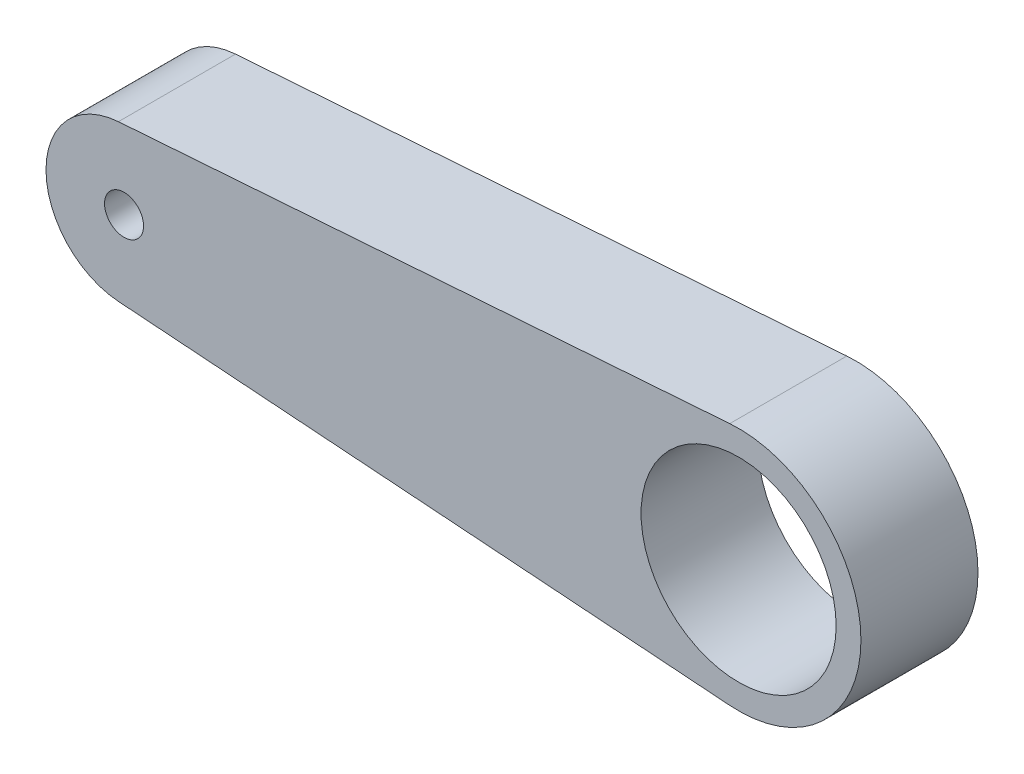
ISO-10303-21;
HEADER;
FILE_DESCRIPTION(('STEP AP214'),'2;1');
FILE_NAME('part.step','',(''),(''),'','','');
FILE_SCHEMA(('AUTOMOTIVE_DESIGN { 1 0 10303 214 1 1 1 1 }'));
ENDSEC;
DATA;
#1=APPLICATION_CONTEXT('core data for automotive mechanical design processes');
#2=APPLICATION_PROTOCOL_DEFINITION('international standard','automotive_design',2000,#1);
#3=PRODUCT_CONTEXT('',#1,'mechanical');
#4=PRODUCT('Part','Part','',(#3));
#5=PRODUCT_RELATED_PRODUCT_CATEGORY('part','',(#4));
#6=PRODUCT_DEFINITION_FORMATION('','',#4);
#7=PRODUCT_DEFINITION_CONTEXT('part definition',#1,'design');
#8=PRODUCT_DEFINITION('design','',#6,#7);
#9=PRODUCT_DEFINITION_SHAPE('','',#8);
#10=(LENGTH_UNIT() NAMED_UNIT(*) SI_UNIT(.MILLI.,.METRE.));
#11=(NAMED_UNIT(*) PLANE_ANGLE_UNIT() SI_UNIT($,.RADIAN.));
#12=(NAMED_UNIT(*) SI_UNIT($,.STERADIAN.) SOLID_ANGLE_UNIT());
#13=UNCERTAINTY_MEASURE_WITH_UNIT(LENGTH_MEASURE(1.E-05),#10,'distance_accuracy_value','');
#14=(GEOMETRIC_REPRESENTATION_CONTEXT(3) GLOBAL_UNCERTAINTY_ASSIGNED_CONTEXT((#13)) GLOBAL_UNIT_ASSIGNED_CONTEXT((#10,
#11,#12)) REPRESENTATION_CONTEXT('',''));
#15=CARTESIAN_POINT('',(0.,0.,0.));
#16=DIRECTION('',(0.,0.,1.));
#17=DIRECTION('',(1.,0.,0.));
#18=AXIS2_PLACEMENT_3D('',#15,#16,#17);
#19=CARTESIAN_POINT('',(0.,0.,1.5));
#20=DIRECTION('',(0.,0.,1.));
#21=DIRECTION('',(1.,0.,0.));
#22=AXIS2_PLACEMENT_3D('',#19,#20,#21);
#23=PLANE('',#22);
#24=CARTESIAN_POINT('',(0.,0.,1.5));
#25=DIRECTION('',(0.,0.,1.));
#26=DIRECTION('',(1.,0.,0.));
#27=AXIS2_PLACEMENT_3D('',#24,#25,#26);
#28=CIRCLE('',#27,0.5);
#29=CARTESIAN_POINT('',(0.5,0.,1.5));
#30=VERTEX_POINT('',#29);
#31=EDGE_CURVE('E113',#30,#30,#28,.T.);
#32=ORIENTED_EDGE('',*,*,#31,.F.);
#33=EDGE_LOOP('',(#32));
#34=FACE_BOUND('',#33,.T.);
#35=DIRECTION('',(0.99739743106567,-0.0720996844903074,0.));
#36=VECTOR('',#35,1.);
#37=CARTESIAN_POINT('',(-0.144199368980615,-1.99479486213134,1.5));
#38=LINE('',#37,#36);
#39=CARTESIAN_POINT('',(-0.144199368980615,-1.99479486213134,1.5));
#40=VERTEX_POINT('',#39);
#41=CARTESIAN_POINT('',(15.5239263900877,-3.12740949356897,1.5));
#42=VERTEX_POINT('',#41);
#43=EDGE_CURVE('E102',#40,#42,#38,.T.);
#44=ORIENTED_EDGE('',*,*,#43,.T.);
#45=CARTESIAN_POINT('',(15.75,0.,1.5));
#46=DIRECTION('',(0.,0.,1.));
#47=DIRECTION('',(1.,0.,0.));
#48=AXIS2_PLACEMENT_3D('',#45,#46,#47);
#49=CIRCLE('',#48,3.13557003072234);
#50=CARTESIAN_POINT('',(15.5239263900877,3.12740949356897,1.5));
#51=VERTEX_POINT('',#50);
#52=EDGE_CURVE('E97',#42,#51,#49,.T.);
#53=ORIENTED_EDGE('',*,*,#52,.T.);
#54=DIRECTION('',(0.99739743106567,0.0720996844903075,0.));
#55=VECTOR('',#54,1.);
#56=CARTESIAN_POINT('',(-0.144199368980615,1.99479486213134,1.5));
#57=LINE('',#56,#55);
#58=CARTESIAN_POINT('',(-0.144199368980615,1.99479486213134,1.5));
#59=VERTEX_POINT('',#58);
#60=EDGE_CURVE('E100',#59,#51,#57,.T.);
#61=ORIENTED_EDGE('',*,*,#60,.F.);
#62=CARTESIAN_POINT('',(0.,0.,1.5));
#63=DIRECTION('',(0.,0.,1.));
#64=DIRECTION('',(1.,0.,0.));
#65=AXIS2_PLACEMENT_3D('',#62,#63,#64);
#66=CIRCLE('',#65,2.);
#67=EDGE_CURVE('E71',#59,#40,#66,.T.);
#68=ORIENTED_EDGE('',*,*,#67,.T.);
#69=EDGE_LOOP('',(#44,#53,#61,#68));
#70=FACE_BOUND('',#69,.T.);
#71=CARTESIAN_POINT('',(15.75,0.,1.5));
#72=DIRECTION('',(0.,0.,1.));
#73=DIRECTION('',(1.,0.,0.));
#74=AXIS2_PLACEMENT_3D('',#71,#72,#73);
#75=CIRCLE('',#74,2.5);
#76=CARTESIAN_POINT('',(18.25,0.,1.5));
#77=VERTEX_POINT('',#76);
#78=EDGE_CURVE('E123',#77,#77,#75,.T.);
#79=ORIENTED_EDGE('',*,*,#78,.F.);
#80=EDGE_LOOP('',(#79));
#81=FACE_BOUND('',#80,.T.);
#82=ADVANCED_FACE('F54',(#34,#70,#81),#23,.T.);
#83=CARTESIAN_POINT('',(0.,0.,-1.5));
#84=DIRECTION('',(0.,0.,1.));
#85=DIRECTION('',(1.,0.,0.));
#86=AXIS2_PLACEMENT_3D('',#83,#84,#85);
#87=PLANE('',#86);
#88=DIRECTION('',(0.99739743106567,-0.0720996844903074,0.));
#89=VECTOR('',#88,1.);
#90=CARTESIAN_POINT('',(-0.144199368980615,-1.99479486213134,-1.5));
#91=LINE('',#90,#89);
#92=CARTESIAN_POINT('',(-0.144199368980615,-1.99479486213134,-1.5));
#93=VERTEX_POINT('',#92);
#94=CARTESIAN_POINT('',(15.5239263900877,-3.12740949356897,-1.5));
#95=VERTEX_POINT('',#94);
#96=EDGE_CURVE('E120',#93,#95,#91,.T.);
#97=ORIENTED_EDGE('',*,*,#96,.F.);
#98=CARTESIAN_POINT('',(0.,0.,-1.5));
#99=DIRECTION('',(0.,0.,1.));
#100=DIRECTION('',(1.,0.,0.));
#101=AXIS2_PLACEMENT_3D('',#98,#99,#100);
#102=CIRCLE('',#101,2.);
#103=CARTESIAN_POINT('',(-0.144199368980615,1.99479486213134,-1.5));
#104=VERTEX_POINT('',#103);
#105=EDGE_CURVE('E90',#104,#93,#102,.T.);
#106=ORIENTED_EDGE('',*,*,#105,.F.);
#107=DIRECTION('',(0.99739743106567,0.0720996844903075,0.));
#108=VECTOR('',#107,1.);
#109=CARTESIAN_POINT('',(-0.144199368980615,1.99479486213134,-1.5));
#110=LINE('',#109,#108);
#111=CARTESIAN_POINT('',(15.5239263900877,3.12740949356897,-1.5));
#112=VERTEX_POINT('',#111);
#113=EDGE_CURVE('E125',#104,#112,#110,.T.);
#114=ORIENTED_EDGE('',*,*,#113,.T.);
#115=CARTESIAN_POINT('',(15.75,0.,-1.5));
#116=DIRECTION('',(0.,0.,1.));
#117=DIRECTION('',(1.,0.,0.));
#118=AXIS2_PLACEMENT_3D('',#115,#116,#117);
#119=CIRCLE('',#118,3.13557003072234);
#120=EDGE_CURVE('E107',#95,#112,#119,.T.);
#121=ORIENTED_EDGE('',*,*,#120,.F.);
#122=EDGE_LOOP('',(#97,#106,#114,#121));
#123=FACE_BOUND('',#122,.T.);
#124=CARTESIAN_POINT('',(0.,0.,-1.5));
#125=DIRECTION('',(0.,0.,1.));
#126=DIRECTION('',(1.,0.,0.));
#127=AXIS2_PLACEMENT_3D('',#124,#125,#126);
#128=CIRCLE('',#127,0.5);
#129=CARTESIAN_POINT('',(0.5,0.,-1.5));
#130=VERTEX_POINT('',#129);
#131=EDGE_CURVE('E128',#130,#130,#128,.T.);
#132=ORIENTED_EDGE('',*,*,#131,.T.);
#133=EDGE_LOOP('',(#132));
#134=FACE_BOUND('',#133,.T.);
#135=CARTESIAN_POINT('',(15.75,0.,-1.5));
#136=DIRECTION('',(0.,0.,1.));
#137=DIRECTION('',(1.,0.,0.));
#138=AXIS2_PLACEMENT_3D('',#135,#136,#137);
#139=CIRCLE('',#138,2.5);
#140=CARTESIAN_POINT('',(18.25,0.,-1.5));
#141=VERTEX_POINT('',#140);
#142=EDGE_CURVE('E143',#141,#141,#139,.T.);
#143=ORIENTED_EDGE('',*,*,#142,.T.);
#144=EDGE_LOOP('',(#143));
#145=FACE_BOUND('',#144,.T.);
#146=ADVANCED_FACE('F135',(#123,#134,#145),#87,.F.);
#147=CARTESIAN_POINT('',(-0.144199368980615,-1.99479486213134,1.5));
#148=DIRECTION('',(0.0720996844903074,0.99739743106567,0.));
#149=DIRECTION('',(-0.99739743106567,0.0720996844903074,0.));
#150=AXIS2_PLACEMENT_3D('',#147,#148,#149);
#151=PLANE('',#150);
#152=ORIENTED_EDGE('',*,*,#96,.T.);
#153=DIRECTION('',(0.,0.,-1.));
#154=VECTOR('',#153,1.);
#155=CARTESIAN_POINT('',(15.5239263900877,-3.12740949356897,1.5));
#156=LINE('',#155,#154);
#157=EDGE_CURVE('E12',#42,#95,#156,.T.);
#158=ORIENTED_EDGE('',*,*,#157,.F.);
#159=ORIENTED_EDGE('',*,*,#43,.F.);
#160=DIRECTION('',(0.,0.,-1.));
#161=VECTOR('',#160,1.);
#162=CARTESIAN_POINT('',(-0.144199368980615,-1.99479486213134,1.5));
#163=LINE('',#162,#161);
#164=EDGE_CURVE('E119',#40,#93,#163,.T.);
#165=ORIENTED_EDGE('',*,*,#164,.T.);
#166=EDGE_LOOP('',(#152,#158,#159,#165));
#167=FACE_BOUND('',#166,.T.);
#168=ADVANCED_FACE('F56',(#167),#151,.F.);
#169=CARTESIAN_POINT('',(15.75,0.,1.5));
#170=DIRECTION('',(0.,0.,-1.));
#171=DIRECTION('',(-1.,0.,0.));
#172=AXIS2_PLACEMENT_3D('',#169,#170,#171);
#173=CYLINDRICAL_SURFACE('',#172,3.13557003072234);
#174=ORIENTED_EDGE('',*,*,#120,.T.);
#175=DIRECTION('',(0.,0.,-1.));
#176=VECTOR('',#175,1.);
#177=CARTESIAN_POINT('',(15.5239263900877,3.12740949356897,1.5));
#178=LINE('',#177,#176);
#179=EDGE_CURVE('E63',#51,#112,#178,.T.);
#180=ORIENTED_EDGE('',*,*,#179,.F.);
#181=ORIENTED_EDGE('',*,*,#52,.F.);
#182=ORIENTED_EDGE('',*,*,#157,.T.);
#183=EDGE_LOOP('',(#174,#180,#181,#182));
#184=FACE_BOUND('',#183,.T.);
#185=ADVANCED_FACE('F106',(#184),#173,.T.);
#186=CARTESIAN_POINT('',(-0.144199368980615,1.99479486213134,1.5));
#187=DIRECTION('',(-0.0720996844903075,0.99739743106567,0.));
#188=DIRECTION('',(-0.99739743106567,-0.0720996844903075,0.));
#189=AXIS2_PLACEMENT_3D('',#186,#187,#188);
#190=PLANE('',#189);
#191=ORIENTED_EDGE('',*,*,#113,.F.);
#192=DIRECTION('',(0.,0.,-1.));
#193=VECTOR('',#192,1.);
#194=CARTESIAN_POINT('',(-0.144199368980615,1.99479486213134,1.5));
#195=LINE('',#194,#193);
#196=EDGE_CURVE('E87',#59,#104,#195,.T.);
#197=ORIENTED_EDGE('',*,*,#196,.F.);
#198=ORIENTED_EDGE('',*,*,#60,.T.);
#199=ORIENTED_EDGE('',*,*,#179,.T.);
#200=EDGE_LOOP('',(#191,#197,#198,#199));
#201=FACE_BOUND('',#200,.T.);
#202=ADVANCED_FACE('F111',(#201),#190,.T.);
#203=CARTESIAN_POINT('',(0.,0.,1.5));
#204=DIRECTION('',(0.,0.,-1.));
#205=DIRECTION('',(-1.,0.,0.));
#206=AXIS2_PLACEMENT_3D('',#203,#204,#205);
#207=CYLINDRICAL_SURFACE('',#206,2.);
#208=ORIENTED_EDGE('',*,*,#105,.T.);
#209=ORIENTED_EDGE('',*,*,#164,.F.);
#210=ORIENTED_EDGE('',*,*,#67,.F.);
#211=ORIENTED_EDGE('',*,*,#196,.T.);
#212=EDGE_LOOP('',(#208,#209,#210,#211));
#213=FACE_BOUND('',#212,.T.);
#214=ADVANCED_FACE('F162',(#213),#207,.T.);
#215=CARTESIAN_POINT('',(0.,0.,1.5));
#216=DIRECTION('',(0.,0.,-1.));
#217=DIRECTION('',(-1.,0.,0.));
#218=AXIS2_PLACEMENT_3D('',#215,#216,#217);
#219=CYLINDRICAL_SURFACE('',#218,0.5);
#220=ORIENTED_EDGE('',*,*,#31,.T.);
#221=EDGE_LOOP('',(#220));
#222=FACE_BOUND('',#221,.T.);
#223=ORIENTED_EDGE('',*,*,#131,.F.);
#224=EDGE_LOOP('',(#223));
#225=FACE_BOUND('',#224,.T.);
#226=ADVANCED_FACE('F159',(#222,#225),#219,.F.);
#227=CARTESIAN_POINT('',(15.75,0.,1.5));
#228=DIRECTION('',(0.,0.,-1.));
#229=DIRECTION('',(-1.,0.,0.));
#230=AXIS2_PLACEMENT_3D('',#227,#228,#229);
#231=CYLINDRICAL_SURFACE('',#230,2.5);
#232=ORIENTED_EDGE('',*,*,#78,.T.);
#233=EDGE_LOOP('',(#232));
#234=FACE_BOUND('',#233,.T.);
#235=ORIENTED_EDGE('',*,*,#142,.F.);
#236=EDGE_LOOP('',(#235));
#237=FACE_BOUND('',#236,.T.);
#238=ADVANCED_FACE('F150',(#234,#237),#231,.F.);
#239=CLOSED_SHELL('',(#82,#146,#168,#185,#202,#214,#226,#238));
#240=MANIFOLD_SOLID_BREP('B2',#239);
#241=ADVANCED_BREP_SHAPE_REPRESENTATION('',(#18,#240),#14);
#242=SHAPE_DEFINITION_REPRESENTATION(#9,#241);
ENDSEC;
END-ISO-10303-21;
